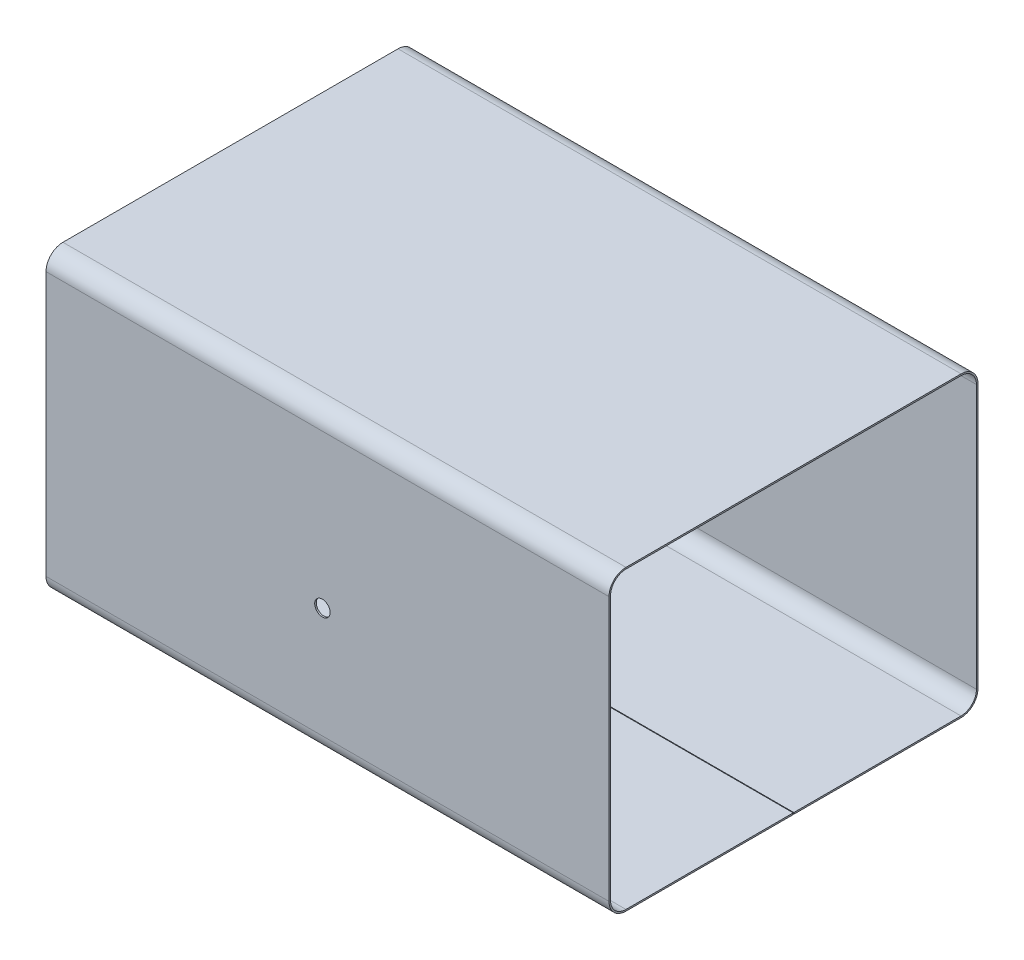
ISO-10303-21;
HEADER;
FILE_DESCRIPTION(('STEP AP214'),'2;1');
FILE_NAME('part.step','',(''),(''),'','','');
FILE_SCHEMA(('AUTOMOTIVE_DESIGN { 1 0 10303 214 1 1 1 1 }'));
ENDSEC;
DATA;
#1=APPLICATION_CONTEXT('core data for automotive mechanical design processes');
#2=APPLICATION_PROTOCOL_DEFINITION('international standard','automotive_design',2000,#1);
#3=PRODUCT_CONTEXT('',#1,'mechanical');
#4=PRODUCT('Part','Part','',(#3));
#5=PRODUCT_RELATED_PRODUCT_CATEGORY('part','',(#4));
#6=PRODUCT_DEFINITION_FORMATION('','',#4);
#7=PRODUCT_DEFINITION_CONTEXT('part definition',#1,'design');
#8=PRODUCT_DEFINITION('design','',#6,#7);
#9=PRODUCT_DEFINITION_SHAPE('','',#8);
#10=(LENGTH_UNIT() NAMED_UNIT(*) SI_UNIT(.MILLI.,.METRE.));
#11=(NAMED_UNIT(*) PLANE_ANGLE_UNIT() SI_UNIT($,.RADIAN.));
#12=(NAMED_UNIT(*) SI_UNIT($,.STERADIAN.) SOLID_ANGLE_UNIT());
#13=UNCERTAINTY_MEASURE_WITH_UNIT(LENGTH_MEASURE(1.E-05),#10,'distance_accuracy_value','');
#14=(GEOMETRIC_REPRESENTATION_CONTEXT(3) GLOBAL_UNCERTAINTY_ASSIGNED_CONTEXT((#13)) GLOBAL_UNIT_ASSIGNED_CONTEXT((#10,
#11,#12)) REPRESENTATION_CONTEXT('',''));
#15=CARTESIAN_POINT('',(0.,0.,0.));
#16=DIRECTION('',(0.,0.,1.));
#17=DIRECTION('',(1.,0.,0.));
#18=AXIS2_PLACEMENT_3D('',#15,#16,#17);
#19=CARTESIAN_POINT('',(-182.7,-48.3186465873429,54.3691641497024));
#20=DIRECTION('',(0.,-1.,0.));
#21=DIRECTION('',(0.,0.,-1.));
#22=AXIS2_PLACEMENT_3D('',#19,#20,#21);
#23=PLANE('',#22);
#24=DIRECTION('',(0.,0.,-1.));
#25=VECTOR('',#24,1.);
#26=CARTESIAN_POINT('',(0.,-48.3186465873429,54.3691641497024));
#27=LINE('',#26,#25);
#28=CARTESIAN_POINT('',(0.,-48.3186465873429,54.3691641497024));
#29=VERTEX_POINT('',#28);
#30=CARTESIAN_POINT('',(0.,-48.3186465873429,0.100000000000003));
#31=VERTEX_POINT('',#30);
#32=EDGE_CURVE('E204',#29,#31,#27,.T.);
#33=ORIENTED_EDGE('',*,*,#32,.F.);
#34=DIRECTION('',(1.,0.,0.));
#35=VECTOR('',#34,1.);
#36=CARTESIAN_POINT('',(-182.7,-48.3186465873429,54.3691641497024));
#37=LINE('',#36,#35);
#38=CARTESIAN_POINT('',(-182.7,-48.3186465873429,54.3691641497024));
#39=VERTEX_POINT('',#38);
#40=EDGE_CURVE('E11',#39,#29,#37,.T.);
#41=ORIENTED_EDGE('',*,*,#40,.F.);
#42=DIRECTION('',(0.,0.,-1.));
#43=VECTOR('',#42,1.);
#44=CARTESIAN_POINT('',(-182.7,-48.3186465873429,54.3691641497024));
#45=LINE('',#44,#43);
#46=CARTESIAN_POINT('',(-182.7,-48.3186465873429,0.100000000000003));
#47=VERTEX_POINT('',#46);
#48=EDGE_CURVE('E251',#39,#47,#45,.T.);
#49=ORIENTED_EDGE('',*,*,#48,.T.);
#50=DIRECTION('',(1.,0.,0.));
#51=VECTOR('',#50,1.);
#52=CARTESIAN_POINT('',(-182.7,-48.3186465873429,0.100000000000003));
#53=LINE('',#52,#51);
#54=EDGE_CURVE('E203',#47,#31,#53,.T.);
#55=ORIENTED_EDGE('',*,*,#54,.T.);
#56=EDGE_LOOP('',(#33,#41,#49,#55));
#57=FACE_BOUND('',#56,.T.);
#58=ADVANCED_FACE('F35',(#57),#23,.T.);
#59=CARTESIAN_POINT('',(-182.7,-42.8186465873429,54.3691641497024));
#60=DIRECTION('',(1.,0.,0.));
#61=DIRECTION('',(0.,0.,-1.));
#62=AXIS2_PLACEMENT_3D('',#59,#60,#61);
#63=CYLINDRICAL_SURFACE('',#62,5.5);
#64=CARTESIAN_POINT('',(0.,-42.8186465873429,54.3691641497024));
#65=DIRECTION('',(1.,0.,0.));
#66=DIRECTION('',(0.,0.,-1.));
#67=AXIS2_PLACEMENT_3D('',#64,#65,#66);
#68=CIRCLE('',#67,5.5);
#69=CARTESIAN_POINT('',(0.,-42.8186465873429,59.8691641497024));
#70=VERTEX_POINT('',#69);
#71=EDGE_CURVE('E249',#70,#29,#68,.T.);
#72=ORIENTED_EDGE('',*,*,#71,.F.);
#73=DIRECTION('',(1.,0.,0.));
#74=VECTOR('',#73,1.);
#75=CARTESIAN_POINT('',(-182.7,-42.8186465873429,59.8691641497024));
#76=LINE('',#75,#74);
#77=CARTESIAN_POINT('',(-182.7,-42.8186465873429,59.8691641497024));
#78=VERTEX_POINT('',#77);
#79=EDGE_CURVE('E44',#78,#70,#76,.T.);
#80=ORIENTED_EDGE('',*,*,#79,.F.);
#81=CARTESIAN_POINT('',(-182.7,-42.8186465873429,54.3691641497024));
#82=DIRECTION('',(1.,0.,0.));
#83=DIRECTION('',(0.,0.,-1.));
#84=AXIS2_PLACEMENT_3D('',#81,#82,#83);
#85=CIRCLE('',#84,5.5);
#86=EDGE_CURVE('E193',#78,#39,#85,.T.);
#87=ORIENTED_EDGE('',*,*,#86,.T.);
#88=ORIENTED_EDGE('',*,*,#40,.T.);
#89=EDGE_LOOP('',(#72,#80,#87,#88));
#90=FACE_BOUND('',#89,.T.);
#91=ADVANCED_FACE('F301',(#90),#63,.T.);
#92=CARTESIAN_POINT('',(-182.7,-42.8186465873429,59.8691641497024));
#93=DIRECTION('',(0.,0.,1.));
#94=DIRECTION('',(1.,0.,0.));
#95=AXIS2_PLACEMENT_3D('',#92,#93,#94);
#96=PLANE('',#95);
#97=CARTESIAN_POINT('',(-93.0069468006124,-6.88677821628847,59.8691641497024));
#98=DIRECTION('',(0.,0.,1.));
#99=DIRECTION('',(1.,0.,0.));
#100=AXIS2_PLACEMENT_3D('',#97,#98,#99);
#101=CIRCLE('',#100,2.5);
#102=CARTESIAN_POINT('',(-90.5069468006124,-6.88677821628847,59.8691641497024));
#103=VERTEX_POINT('',#102);
#104=EDGE_CURVE('E400',#103,#103,#101,.T.);
#105=ORIENTED_EDGE('',*,*,#104,.F.);
#106=EDGE_LOOP('',(#105));
#107=FACE_BOUND('',#106,.T.);
#108=DIRECTION('',(0.,1.,0.));
#109=VECTOR('',#108,1.);
#110=CARTESIAN_POINT('',(0.,-42.8186465873429,59.8691641497024));
#111=LINE('',#110,#109);
#112=CARTESIAN_POINT('',(0.,42.8186465873429,59.8691641497024));
#113=VERTEX_POINT('',#112);
#114=EDGE_CURVE('E181',#113,#70,#111,.F.);
#115=ORIENTED_EDGE('',*,*,#114,.F.);
#116=DIRECTION('',(1.,0.,0.));
#117=VECTOR('',#116,1.);
#118=CARTESIAN_POINT('',(-182.7,42.8186465873429,59.8691641497024));
#119=LINE('',#118,#117);
#120=CARTESIAN_POINT('',(-182.7,42.8186465873429,59.8691641497024));
#121=VERTEX_POINT('',#120);
#122=EDGE_CURVE('E176',#121,#113,#119,.T.);
#123=ORIENTED_EDGE('',*,*,#122,.F.);
#124=DIRECTION('',(0.,1.,0.));
#125=VECTOR('',#124,1.);
#126=CARTESIAN_POINT('',(-182.7,-42.8186465873429,59.8691641497024));
#127=LINE('',#126,#125);
#128=EDGE_CURVE('E179',#121,#78,#127,.F.);
#129=ORIENTED_EDGE('',*,*,#128,.T.);
#130=ORIENTED_EDGE('',*,*,#79,.T.);
#131=EDGE_LOOP('',(#115,#123,#129,#130));
#132=FACE_BOUND('',#131,.T.);
#133=ADVANCED_FACE('F178',(#107,#132),#96,.T.);
#134=CARTESIAN_POINT('',(-182.7,42.8186465873429,54.3691641497024));
#135=DIRECTION('',(1.,0.,0.));
#136=DIRECTION('',(0.,0.,-1.));
#137=AXIS2_PLACEMENT_3D('',#134,#135,#136);
#138=CYLINDRICAL_SURFACE('',#137,5.5);
#139=CARTESIAN_POINT('',(0.,42.8186465873429,54.3691641497024));
#140=DIRECTION('',(1.,0.,0.));
#141=DIRECTION('',(0.,0.,-1.));
#142=AXIS2_PLACEMENT_3D('',#139,#140,#141);
#143=CIRCLE('',#142,5.5);
#144=CARTESIAN_POINT('',(0.,48.3186465873429,54.3691641497024));
#145=VERTEX_POINT('',#144);
#146=EDGE_CURVE('E246',#145,#113,#143,.T.);
#147=ORIENTED_EDGE('',*,*,#146,.F.);
#148=DIRECTION('',(1.,0.,0.));
#149=VECTOR('',#148,1.);
#150=CARTESIAN_POINT('',(-182.7,48.3186465873429,54.3691641497024));
#151=LINE('',#150,#149);
#152=CARTESIAN_POINT('',(-182.7,48.3186465873429,54.3691641497024));
#153=VERTEX_POINT('',#152);
#154=EDGE_CURVE('E186',#153,#145,#151,.T.);
#155=ORIENTED_EDGE('',*,*,#154,.F.);
#156=CARTESIAN_POINT('',(-182.7,42.8186465873429,54.3691641497024));
#157=DIRECTION('',(1.,0.,0.));
#158=DIRECTION('',(0.,0.,-1.));
#159=AXIS2_PLACEMENT_3D('',#156,#157,#158);
#160=CIRCLE('',#159,5.5);
#161=EDGE_CURVE('E191',#153,#121,#160,.T.);
#162=ORIENTED_EDGE('',*,*,#161,.T.);
#163=ORIENTED_EDGE('',*,*,#122,.T.);
#164=EDGE_LOOP('',(#147,#155,#162,#163));
#165=FACE_BOUND('',#164,.T.);
#166=ADVANCED_FACE('F195',(#165),#138,.T.);
#167=CARTESIAN_POINT('',(-182.7,48.3186465873429,54.3691641497024));
#168=DIRECTION('',(0.,1.,0.));
#169=DIRECTION('',(0.,0.,1.));
#170=AXIS2_PLACEMENT_3D('',#167,#168,#169);
#171=PLANE('',#170);
#172=DIRECTION('',(0.,0.,-1.));
#173=VECTOR('',#172,1.);
#174=CARTESIAN_POINT('',(0.,48.3186465873429,54.3691641497024));
#175=LINE('',#174,#173);
#176=CARTESIAN_POINT('',(0.,48.3186465873429,-54.3691641497024));
#177=VERTEX_POINT('',#176);
#178=EDGE_CURVE('E243',#177,#145,#175,.F.);
#179=ORIENTED_EDGE('',*,*,#178,.F.);
#180=DIRECTION('',(1.,0.,0.));
#181=VECTOR('',#180,1.);
#182=CARTESIAN_POINT('',(-182.7,48.3186465873429,-54.3691641497024));
#183=LINE('',#182,#181);
#184=CARTESIAN_POINT('',(-182.7,48.3186465873429,-54.3691641497024));
#185=VERTEX_POINT('',#184);
#186=EDGE_CURVE('E255',#185,#177,#183,.T.);
#187=ORIENTED_EDGE('',*,*,#186,.F.);
#188=DIRECTION('',(0.,0.,-1.));
#189=VECTOR('',#188,1.);
#190=CARTESIAN_POINT('',(-182.7,48.3186465873429,54.3691641497024));
#191=LINE('',#190,#189);
#192=EDGE_CURVE('E196',#185,#153,#191,.F.);
#193=ORIENTED_EDGE('',*,*,#192,.T.);
#194=ORIENTED_EDGE('',*,*,#154,.T.);
#195=EDGE_LOOP('',(#179,#187,#193,#194));
#196=FACE_BOUND('',#195,.T.);
#197=ADVANCED_FACE('F315',(#196),#171,.T.);
#198=CARTESIAN_POINT('',(-182.7,42.8186465873429,-54.3691641497024));
#199=DIRECTION('',(1.,0.,0.));
#200=DIRECTION('',(0.,0.,-1.));
#201=AXIS2_PLACEMENT_3D('',#198,#199,#200);
#202=CYLINDRICAL_SURFACE('',#201,5.5);
#203=CARTESIAN_POINT('',(0.,42.8186465873429,-54.3691641497024));
#204=DIRECTION('',(1.,0.,0.));
#205=DIRECTION('',(0.,0.,-1.));
#206=AXIS2_PLACEMENT_3D('',#203,#204,#205);
#207=CIRCLE('',#206,5.5);
#208=CARTESIAN_POINT('',(0.,42.8186465873429,-59.8691641497024));
#209=VERTEX_POINT('',#208);
#210=EDGE_CURVE('E240',#209,#177,#207,.T.);
#211=ORIENTED_EDGE('',*,*,#210,.F.);
#212=DIRECTION('',(1.,0.,0.));
#213=VECTOR('',#212,1.);
#214=CARTESIAN_POINT('',(-182.7,42.8186465873429,-59.8691641497024));
#215=LINE('',#214,#213);
#216=CARTESIAN_POINT('',(-182.7,42.8186465873429,-59.8691641497024));
#217=VERTEX_POINT('',#216);
#218=EDGE_CURVE('E257',#217,#209,#215,.T.);
#219=ORIENTED_EDGE('',*,*,#218,.F.);
#220=CARTESIAN_POINT('',(-182.7,42.8186465873429,-54.3691641497024));
#221=DIRECTION('',(1.,0.,0.));
#222=DIRECTION('',(0.,0.,-1.));
#223=AXIS2_PLACEMENT_3D('',#220,#221,#222);
#224=CIRCLE('',#223,5.5);
#225=EDGE_CURVE('E198',#217,#185,#224,.T.);
#226=ORIENTED_EDGE('',*,*,#225,.T.);
#227=ORIENTED_EDGE('',*,*,#186,.T.);
#228=EDGE_LOOP('',(#211,#219,#226,#227));
#229=FACE_BOUND('',#228,.T.);
#230=ADVANCED_FACE('F318',(#229),#202,.T.);
#231=CARTESIAN_POINT('',(-182.7,-42.818646587343,-59.8691641497024));
#232=DIRECTION('',(0.,0.,-1.));
#233=DIRECTION('',(-1.,0.,0.));
#234=AXIS2_PLACEMENT_3D('',#231,#232,#233);
#235=PLANE('',#234);
#236=CARTESIAN_POINT('',(-93.0069468006124,-6.88677821628847,-59.8691641497024));
#237=DIRECTION('',(0.,0.,1.));
#238=DIRECTION('',(1.,0.,0.));
#239=AXIS2_PLACEMENT_3D('',#236,#237,#238);
#240=CIRCLE('',#239,2.5);
#241=CARTESIAN_POINT('',(-90.5069468006124,-6.88677821628847,-59.8691641497024));
#242=VERTEX_POINT('',#241);
#243=EDGE_CURVE('E393',#242,#242,#240,.T.);
#244=ORIENTED_EDGE('',*,*,#243,.T.);
#245=EDGE_LOOP('',(#244));
#246=FACE_BOUND('',#245,.T.);
#247=DIRECTION('',(0.,1.,0.));
#248=VECTOR('',#247,1.);
#249=CARTESIAN_POINT('',(0.,-42.818646587343,-59.8691641497024));
#250=LINE('',#249,#248);
#251=CARTESIAN_POINT('',(0.,-42.818646587343,-59.8691641497024));
#252=VERTEX_POINT('',#251);
#253=EDGE_CURVE('E237',#252,#209,#250,.T.);
#254=ORIENTED_EDGE('',*,*,#253,.F.);
#255=DIRECTION('',(1.,0.,0.));
#256=VECTOR('',#255,1.);
#257=CARTESIAN_POINT('',(-182.7,-42.818646587343,-59.8691641497024));
#258=LINE('',#257,#256);
#259=CARTESIAN_POINT('',(-182.7,-42.818646587343,-59.8691641497024));
#260=VERTEX_POINT('',#259);
#261=EDGE_CURVE('E259',#260,#252,#258,.T.);
#262=ORIENTED_EDGE('',*,*,#261,.F.);
#263=DIRECTION('',(0.,1.,0.));
#264=VECTOR('',#263,1.);
#265=CARTESIAN_POINT('',(-182.7,-42.818646587343,-59.8691641497024));
#266=LINE('',#265,#264);
#267=EDGE_CURVE('E430',#260,#217,#266,.T.);
#268=ORIENTED_EDGE('',*,*,#267,.T.);
#269=ORIENTED_EDGE('',*,*,#218,.T.);
#270=EDGE_LOOP('',(#254,#262,#268,#269));
#271=FACE_BOUND('',#270,.T.);
#272=ADVANCED_FACE('F322',(#246,#271),#235,.T.);
#273=CARTESIAN_POINT('',(-182.7,-42.818646587343,-54.3691641497024));
#274=DIRECTION('',(1.,0.,0.));
#275=DIRECTION('',(0.,0.,-1.));
#276=AXIS2_PLACEMENT_3D('',#273,#274,#275);
#277=CYLINDRICAL_SURFACE('',#276,5.5);
#278=CARTESIAN_POINT('',(0.,-42.818646587343,-54.3691641497024));
#279=DIRECTION('',(1.,0.,0.));
#280=DIRECTION('',(0.,0.,-1.));
#281=AXIS2_PLACEMENT_3D('',#278,#279,#280);
#282=CIRCLE('',#281,5.5);
#283=CARTESIAN_POINT('',(0.,-48.318646587343,-54.3691641497024));
#284=VERTEX_POINT('',#283);
#285=EDGE_CURVE('E234',#284,#252,#282,.T.);
#286=ORIENTED_EDGE('',*,*,#285,.F.);
#287=DIRECTION('',(1.,0.,0.));
#288=VECTOR('',#287,1.);
#289=CARTESIAN_POINT('',(-182.7,-48.318646587343,-54.3691641497024));
#290=LINE('',#289,#288);
#291=CARTESIAN_POINT('',(-182.7,-48.318646587343,-54.3691641497024));
#292=VERTEX_POINT('',#291);
#293=EDGE_CURVE('E261',#292,#284,#290,.T.);
#294=ORIENTED_EDGE('',*,*,#293,.F.);
#295=CARTESIAN_POINT('',(-182.7,-42.818646587343,-54.3691641497024));
#296=DIRECTION('',(1.,0.,0.));
#297=DIRECTION('',(0.,0.,-1.));
#298=AXIS2_PLACEMENT_3D('',#295,#296,#297);
#299=CIRCLE('',#298,5.5);
#300=EDGE_CURVE('E427',#292,#260,#299,.T.);
#301=ORIENTED_EDGE('',*,*,#300,.T.);
#302=ORIENTED_EDGE('',*,*,#261,.T.);
#303=EDGE_LOOP('',(#286,#294,#301,#302));
#304=FACE_BOUND('',#303,.T.);
#305=ADVANCED_FACE('F326',(#304),#277,.T.);
#306=CARTESIAN_POINT('',(-182.7,-48.318646587343,-0.0999999999999999));
#307=DIRECTION('',(0.,-1.,0.));
#308=DIRECTION('',(0.,0.,-1.));
#309=AXIS2_PLACEMENT_3D('',#306,#307,#308);
#310=PLANE('',#309);
#311=DIRECTION('',(0.,0.,-1.));
#312=VECTOR('',#311,1.);
#313=CARTESIAN_POINT('',(0.,-48.318646587343,-0.0999999999999999));
#314=LINE('',#313,#312);
#315=CARTESIAN_POINT('',(0.,-48.318646587343,-0.0999999999999999));
#316=VERTEX_POINT('',#315);
#317=EDGE_CURVE('E231',#316,#284,#314,.T.);
#318=ORIENTED_EDGE('',*,*,#317,.F.);
#319=DIRECTION('',(1.,0.,0.));
#320=VECTOR('',#319,1.);
#321=CARTESIAN_POINT('',(-182.7,-48.318646587343,-0.0999999999999999));
#322=LINE('',#321,#320);
#323=CARTESIAN_POINT('',(-182.7,-48.318646587343,-0.0999999999999999));
#324=VERTEX_POINT('',#323);
#325=EDGE_CURVE('E263',#324,#316,#322,.T.);
#326=ORIENTED_EDGE('',*,*,#325,.F.);
#327=DIRECTION('',(0.,0.,-1.));
#328=VECTOR('',#327,1.);
#329=CARTESIAN_POINT('',(-182.7,-48.318646587343,-0.0999999999999999));
#330=LINE('',#329,#328);
#331=EDGE_CURVE('E424',#324,#292,#330,.T.);
#332=ORIENTED_EDGE('',*,*,#331,.T.);
#333=ORIENTED_EDGE('',*,*,#293,.T.);
#334=EDGE_LOOP('',(#318,#326,#332,#333));
#335=FACE_BOUND('',#334,.T.);
#336=ADVANCED_FACE('F330',(#335),#310,.T.);
#337=CARTESIAN_POINT('',(-182.7,-48.318646587343,-0.0999999999999999));
#338=DIRECTION('',(0.,0.,-1.));
#339=DIRECTION('',(0.,1.,0.));
#340=AXIS2_PLACEMENT_3D('',#337,#338,#339);
#341=PLANE('',#340);
#342=DIRECTION('',(0.,1.,0.));
#343=VECTOR('',#342,1.);
#344=CARTESIAN_POINT('',(0.,-48.318646587343,-0.0999999999999999));
#345=LINE('',#344,#343);
#346=CARTESIAN_POINT('',(0.,-47.818646587343,-0.1));
#347=VERTEX_POINT('',#346);
#348=EDGE_CURVE('E229',#316,#347,#345,.T.);
#349=ORIENTED_EDGE('',*,*,#348,.T.);
#350=DIRECTION('',(1.,0.,0.));
#351=VECTOR('',#350,1.);
#352=CARTESIAN_POINT('',(-182.7,-47.818646587343,-0.1));
#353=LINE('',#352,#351);
#354=CARTESIAN_POINT('',(-182.7,-47.818646587343,-0.1));
#355=VERTEX_POINT('',#354);
#356=EDGE_CURVE('E265',#355,#347,#353,.T.);
#357=ORIENTED_EDGE('',*,*,#356,.F.);
#358=DIRECTION('',(0.,1.,0.));
#359=VECTOR('',#358,1.);
#360=CARTESIAN_POINT('',(-182.7,-48.318646587343,-0.0999999999999999));
#361=LINE('',#360,#359);
#362=EDGE_CURVE('E422',#324,#355,#361,.T.);
#363=ORIENTED_EDGE('',*,*,#362,.F.);
#364=ORIENTED_EDGE('',*,*,#325,.T.);
#365=EDGE_LOOP('',(#349,#357,#363,#364));
#366=FACE_BOUND('',#365,.T.);
#367=ADVANCED_FACE('F334',(#366),#341,.F.);
#368=CARTESIAN_POINT('',(-182.7,-47.818646587343,-0.1));
#369=DIRECTION('',(0.,-1.,0.));
#370=DIRECTION('',(0.,0.,-1.));
#371=AXIS2_PLACEMENT_3D('',#368,#369,#370);
#372=PLANE('',#371);
#373=DIRECTION('',(0.,0.,-1.));
#374=VECTOR('',#373,1.);
#375=CARTESIAN_POINT('',(0.,-47.818646587343,-0.1));
#376=LINE('',#375,#374);
#377=CARTESIAN_POINT('',(0.,-47.818646587343,-54.3691641497024));
#378=VERTEX_POINT('',#377);
#379=EDGE_CURVE('E227',#347,#378,#376,.T.);
#380=ORIENTED_EDGE('',*,*,#379,.T.);
#381=DIRECTION('',(1.,0.,0.));
#382=VECTOR('',#381,1.);
#383=CARTESIAN_POINT('',(-182.7,-47.818646587343,-54.3691641497024));
#384=LINE('',#383,#382);
#385=CARTESIAN_POINT('',(-182.7,-47.818646587343,-54.3691641497024));
#386=VERTEX_POINT('',#385);
#387=EDGE_CURVE('E268',#386,#378,#384,.T.);
#388=ORIENTED_EDGE('',*,*,#387,.F.);
#389=DIRECTION('',(0.,0.,-1.));
#390=VECTOR('',#389,1.);
#391=CARTESIAN_POINT('',(-182.7,-47.818646587343,-0.1));
#392=LINE('',#391,#390);
#393=EDGE_CURVE('E420',#355,#386,#392,.T.);
#394=ORIENTED_EDGE('',*,*,#393,.F.);
#395=ORIENTED_EDGE('',*,*,#356,.T.);
#396=EDGE_LOOP('',(#380,#388,#394,#395));
#397=FACE_BOUND('',#396,.T.);
#398=ADVANCED_FACE('F338',(#397),#372,.F.);
#399=CARTESIAN_POINT('',(-182.7,-42.818646587343,-54.3691641497024));
#400=DIRECTION('',(1.,0.,0.));
#401=DIRECTION('',(0.,0.,-1.));
#402=AXIS2_PLACEMENT_3D('',#399,#400,#401);
#403=CYLINDRICAL_SURFACE('',#402,5.);
#404=CARTESIAN_POINT('',(0.,-42.818646587343,-54.3691641497024));
#405=DIRECTION('',(1.,0.,0.));
#406=DIRECTION('',(0.,0.,1.));
#407=AXIS2_PLACEMENT_3D('',#404,#405,#406);
#408=CIRCLE('',#407,5.);
#409=CARTESIAN_POINT('',(0.,-42.818646587343,-59.3691641497024));
#410=VERTEX_POINT('',#409);
#411=EDGE_CURVE('E225',#378,#410,#408,.T.);
#412=ORIENTED_EDGE('',*,*,#411,.T.);
#413=DIRECTION('',(1.,0.,0.));
#414=VECTOR('',#413,1.);
#415=CARTESIAN_POINT('',(-182.7,-42.818646587343,-59.3691641497024));
#416=LINE('',#415,#414);
#417=CARTESIAN_POINT('',(-182.7,-42.818646587343,-59.3691641497024));
#418=VERTEX_POINT('',#417);
#419=EDGE_CURVE('E271',#418,#410,#416,.T.);
#420=ORIENTED_EDGE('',*,*,#419,.F.);
#421=CARTESIAN_POINT('',(-182.7,-42.818646587343,-54.3691641497024));
#422=DIRECTION('',(1.,0.,0.));
#423=DIRECTION('',(0.,0.,1.));
#424=AXIS2_PLACEMENT_3D('',#421,#422,#423);
#425=CIRCLE('',#424,5.);
#426=EDGE_CURVE('E418',#386,#418,#425,.T.);
#427=ORIENTED_EDGE('',*,*,#426,.F.);
#428=ORIENTED_EDGE('',*,*,#387,.T.);
#429=EDGE_LOOP('',(#412,#420,#427,#428));
#430=FACE_BOUND('',#429,.T.);
#431=ADVANCED_FACE('F342',(#430),#403,.F.);
#432=CARTESIAN_POINT('',(-182.7,-42.818646587343,-59.3691641497024));
#433=DIRECTION('',(0.,0.,-1.));
#434=DIRECTION('',(-1.,0.,0.));
#435=AXIS2_PLACEMENT_3D('',#432,#433,#434);
#436=PLANE('',#435);
#437=CARTESIAN_POINT('',(-93.0069468006124,-6.88677821628847,-59.3691641497024));
#438=DIRECTION('',(0.,0.,-1.));
#439=DIRECTION('',(-1.,0.,0.));
#440=AXIS2_PLACEMENT_3D('',#437,#438,#439);
#441=CIRCLE('',#440,2.5);
#442=CARTESIAN_POINT('',(-95.5069468006124,-6.88677821628847,-59.3691641497024));
#443=VERTEX_POINT('',#442);
#444=EDGE_CURVE('E208',#443,#443,#441,.T.);
#445=ORIENTED_EDGE('',*,*,#444,.T.);
#446=EDGE_LOOP('',(#445));
#447=FACE_BOUND('',#446,.T.);
#448=DIRECTION('',(0.,1.,0.));
#449=VECTOR('',#448,1.);
#450=CARTESIAN_POINT('',(0.,-42.818646587343,-59.3691641497024));
#451=LINE('',#450,#449);
#452=CARTESIAN_POINT('',(0.,42.8186465873429,-59.3691641497024));
#453=VERTEX_POINT('',#452);
#454=EDGE_CURVE('E223',#410,#453,#451,.T.);
#455=ORIENTED_EDGE('',*,*,#454,.T.);
#456=DIRECTION('',(1.,0.,0.));
#457=VECTOR('',#456,1.);
#458=CARTESIAN_POINT('',(-182.7,42.8186465873429,-59.3691641497024));
#459=LINE('',#458,#457);
#460=CARTESIAN_POINT('',(-182.7,42.8186465873429,-59.3691641497024));
#461=VERTEX_POINT('',#460);
#462=EDGE_CURVE('E274',#461,#453,#459,.T.);
#463=ORIENTED_EDGE('',*,*,#462,.F.);
#464=DIRECTION('',(0.,1.,0.));
#465=VECTOR('',#464,1.);
#466=CARTESIAN_POINT('',(-182.7,-42.818646587343,-59.3691641497024));
#467=LINE('',#466,#465);
#468=EDGE_CURVE('E416',#418,#461,#467,.T.);
#469=ORIENTED_EDGE('',*,*,#468,.F.);
#470=ORIENTED_EDGE('',*,*,#419,.T.);
#471=EDGE_LOOP('',(#455,#463,#469,#470));
#472=FACE_BOUND('',#471,.T.);
#473=ADVANCED_FACE('F346',(#447,#472),#436,.F.);
#474=CARTESIAN_POINT('',(-182.7,42.8186465873429,-54.3691641497024));
#475=DIRECTION('',(1.,0.,0.));
#476=DIRECTION('',(0.,0.,-1.));
#477=AXIS2_PLACEMENT_3D('',#474,#475,#476);
#478=CYLINDRICAL_SURFACE('',#477,5.);
#479=CARTESIAN_POINT('',(0.,42.8186465873429,-54.3691641497024));
#480=DIRECTION('',(1.,0.,0.));
#481=DIRECTION('',(0.,0.,-1.));
#482=AXIS2_PLACEMENT_3D('',#479,#480,#481);
#483=CIRCLE('',#482,5.);
#484=CARTESIAN_POINT('',(0.,47.8186465873429,-54.3691641497024));
#485=VERTEX_POINT('',#484);
#486=EDGE_CURVE('E221',#453,#485,#483,.T.);
#487=ORIENTED_EDGE('',*,*,#486,.T.);
#488=DIRECTION('',(1.,0.,0.));
#489=VECTOR('',#488,1.);
#490=CARTESIAN_POINT('',(-182.7,47.8186465873429,-54.3691641497024));
#491=LINE('',#490,#489);
#492=CARTESIAN_POINT('',(-182.7,47.8186465873429,-54.3691641497024));
#493=VERTEX_POINT('',#492);
#494=EDGE_CURVE('E277',#493,#485,#491,.T.);
#495=ORIENTED_EDGE('',*,*,#494,.F.);
#496=CARTESIAN_POINT('',(-182.7,42.8186465873429,-54.3691641497024));
#497=DIRECTION('',(1.,0.,0.));
#498=DIRECTION('',(0.,0.,-1.));
#499=AXIS2_PLACEMENT_3D('',#496,#497,#498);
#500=CIRCLE('',#499,5.);
#501=EDGE_CURVE('E414',#461,#493,#500,.T.);
#502=ORIENTED_EDGE('',*,*,#501,.F.);
#503=ORIENTED_EDGE('',*,*,#462,.T.);
#504=EDGE_LOOP('',(#487,#495,#502,#503));
#505=FACE_BOUND('',#504,.T.);
#506=ADVANCED_FACE('F350',(#505),#478,.F.);
#507=CARTESIAN_POINT('',(-182.7,47.8186465873429,54.3691641497024));
#508=DIRECTION('',(0.,1.,0.));
#509=DIRECTION('',(0.,0.,1.));
#510=AXIS2_PLACEMENT_3D('',#507,#508,#509);
#511=PLANE('',#510);
#512=DIRECTION('',(0.,0.,1.));
#513=VECTOR('',#512,1.);
#514=CARTESIAN_POINT('',(0.,47.8186465873429,54.3691641497024));
#515=LINE('',#514,#513);
#516=CARTESIAN_POINT('',(0.,47.8186465873429,54.3691641497024));
#517=VERTEX_POINT('',#516);
#518=EDGE_CURVE('E219',#485,#517,#515,.T.);
#519=ORIENTED_EDGE('',*,*,#518,.T.);
#520=DIRECTION('',(1.,0.,0.));
#521=VECTOR('',#520,1.);
#522=CARTESIAN_POINT('',(-182.7,47.8186465873429,54.3691641497024));
#523=LINE('',#522,#521);
#524=CARTESIAN_POINT('',(-182.7,47.8186465873429,54.3691641497024));
#525=VERTEX_POINT('',#524);
#526=EDGE_CURVE('E280',#525,#517,#523,.T.);
#527=ORIENTED_EDGE('',*,*,#526,.F.);
#528=DIRECTION('',(0.,0.,1.));
#529=VECTOR('',#528,1.);
#530=CARTESIAN_POINT('',(-182.7,47.8186465873429,54.3691641497024));
#531=LINE('',#530,#529);
#532=EDGE_CURVE('E412',#493,#525,#531,.T.);
#533=ORIENTED_EDGE('',*,*,#532,.F.);
#534=ORIENTED_EDGE('',*,*,#494,.T.);
#535=EDGE_LOOP('',(#519,#527,#533,#534));
#536=FACE_BOUND('',#535,.T.);
#537=ADVANCED_FACE('F354',(#536),#511,.F.);
#538=CARTESIAN_POINT('',(-182.7,42.8186465873429,54.3691641497024));
#539=DIRECTION('',(1.,0.,0.));
#540=DIRECTION('',(0.,0.,-1.));
#541=AXIS2_PLACEMENT_3D('',#538,#539,#540);
#542=CYLINDRICAL_SURFACE('',#541,5.);
#543=CARTESIAN_POINT('',(0.,42.8186465873429,54.3691641497024));
#544=DIRECTION('',(1.,0.,0.));
#545=DIRECTION('',(0.,0.,1.));
#546=AXIS2_PLACEMENT_3D('',#543,#544,#545);
#547=CIRCLE('',#546,5.);
#548=CARTESIAN_POINT('',(0.,42.8186465873429,59.3691641497024));
#549=VERTEX_POINT('',#548);
#550=EDGE_CURVE('E217',#517,#549,#547,.T.);
#551=ORIENTED_EDGE('',*,*,#550,.T.);
#552=DIRECTION('',(1.,0.,0.));
#553=VECTOR('',#552,1.);
#554=CARTESIAN_POINT('',(-182.7,42.8186465873429,59.3691641497024));
#555=LINE('',#554,#553);
#556=CARTESIAN_POINT('',(-182.7,42.8186465873429,59.3691641497024));
#557=VERTEX_POINT('',#556);
#558=EDGE_CURVE('E283',#557,#549,#555,.T.);
#559=ORIENTED_EDGE('',*,*,#558,.F.);
#560=CARTESIAN_POINT('',(-182.7,42.8186465873429,54.3691641497024));
#561=DIRECTION('',(1.,0.,0.));
#562=DIRECTION('',(0.,0.,1.));
#563=AXIS2_PLACEMENT_3D('',#560,#561,#562);
#564=CIRCLE('',#563,5.);
#565=EDGE_CURVE('E410',#525,#557,#564,.T.);
#566=ORIENTED_EDGE('',*,*,#565,.F.);
#567=ORIENTED_EDGE('',*,*,#526,.T.);
#568=EDGE_LOOP('',(#551,#559,#566,#567));
#569=FACE_BOUND('',#568,.T.);
#570=ADVANCED_FACE('F358',(#569),#542,.F.);
#571=CARTESIAN_POINT('',(-182.7,-42.8186465873429,59.3691641497024));
#572=DIRECTION('',(0.,0.,1.));
#573=DIRECTION('',(1.,0.,0.));
#574=AXIS2_PLACEMENT_3D('',#571,#572,#573);
#575=PLANE('',#574);
#576=CARTESIAN_POINT('',(-93.0069468006124,-6.88677821628847,59.3691641497024));
#577=DIRECTION('',(0.,0.,1.));
#578=DIRECTION('',(1.,0.,0.));
#579=AXIS2_PLACEMENT_3D('',#576,#577,#578);
#580=CIRCLE('',#579,2.5);
#581=CARTESIAN_POINT('',(-90.5069468006124,-6.88677821628847,59.3691641497024));
#582=VERTEX_POINT('',#581);
#583=EDGE_CURVE('E38',#582,#582,#580,.T.);
#584=ORIENTED_EDGE('',*,*,#583,.T.);
#585=EDGE_LOOP('',(#584));
#586=FACE_BOUND('',#585,.T.);
#587=DIRECTION('',(0.,-1.,0.));
#588=VECTOR('',#587,1.);
#589=CARTESIAN_POINT('',(0.,-42.8186465873429,59.3691641497024));
#590=LINE('',#589,#588);
#591=CARTESIAN_POINT('',(0.,-42.8186465873429,59.3691641497024));
#592=VERTEX_POINT('',#591);
#593=EDGE_CURVE('E215',#549,#592,#590,.T.);
#594=ORIENTED_EDGE('',*,*,#593,.T.);
#595=DIRECTION('',(1.,0.,0.));
#596=VECTOR('',#595,1.);
#597=CARTESIAN_POINT('',(-182.7,-42.8186465873429,59.3691641497024));
#598=LINE('',#597,#596);
#599=CARTESIAN_POINT('',(-182.7,-42.8186465873429,59.3691641497024));
#600=VERTEX_POINT('',#599);
#601=EDGE_CURVE('E286',#600,#592,#598,.T.);
#602=ORIENTED_EDGE('',*,*,#601,.F.);
#603=DIRECTION('',(0.,-1.,0.));
#604=VECTOR('',#603,1.);
#605=CARTESIAN_POINT('',(-182.7,-42.8186465873429,59.3691641497024));
#606=LINE('',#605,#604);
#607=EDGE_CURVE('E408',#557,#600,#606,.T.);
#608=ORIENTED_EDGE('',*,*,#607,.F.);
#609=ORIENTED_EDGE('',*,*,#558,.T.);
#610=EDGE_LOOP('',(#594,#602,#608,#609));
#611=FACE_BOUND('',#610,.T.);
#612=ADVANCED_FACE('F362',(#586,#611),#575,.F.);
#613=CARTESIAN_POINT('',(-182.7,-42.8186465873429,54.3691641497024));
#614=DIRECTION('',(1.,0.,0.));
#615=DIRECTION('',(0.,0.,-1.));
#616=AXIS2_PLACEMENT_3D('',#613,#614,#615);
#617=CYLINDRICAL_SURFACE('',#616,5.);
#618=CARTESIAN_POINT('',(0.,-42.8186465873429,54.3691641497024));
#619=DIRECTION('',(1.,0.,0.));
#620=DIRECTION('',(0.,0.,-1.));
#621=AXIS2_PLACEMENT_3D('',#618,#619,#620);
#622=CIRCLE('',#621,5.);
#623=CARTESIAN_POINT('',(0.,-47.8186465873429,54.3691641497024));
#624=VERTEX_POINT('',#623);
#625=EDGE_CURVE('E213',#592,#624,#622,.T.);
#626=ORIENTED_EDGE('',*,*,#625,.T.);
#627=DIRECTION('',(1.,0.,0.));
#628=VECTOR('',#627,1.);
#629=CARTESIAN_POINT('',(-182.7,-47.8186465873429,54.3691641497024));
#630=LINE('',#629,#628);
#631=CARTESIAN_POINT('',(-182.7,-47.8186465873429,54.3691641497024));
#632=VERTEX_POINT('',#631);
#633=EDGE_CURVE('E289',#632,#624,#630,.T.);
#634=ORIENTED_EDGE('',*,*,#633,.F.);
#635=CARTESIAN_POINT('',(-182.7,-42.8186465873429,54.3691641497024));
#636=DIRECTION('',(1.,0.,0.));
#637=DIRECTION('',(0.,0.,-1.));
#638=AXIS2_PLACEMENT_3D('',#635,#636,#637);
#639=CIRCLE('',#638,5.);
#640=EDGE_CURVE('E406',#600,#632,#639,.T.);
#641=ORIENTED_EDGE('',*,*,#640,.F.);
#642=ORIENTED_EDGE('',*,*,#601,.T.);
#643=EDGE_LOOP('',(#626,#634,#641,#642));
#644=FACE_BOUND('',#643,.T.);
#645=ADVANCED_FACE('F366',(#644),#617,.F.);
#646=CARTESIAN_POINT('',(-182.7,-47.8186465873429,54.3691641497024));
#647=DIRECTION('',(0.,-1.,0.));
#648=DIRECTION('',(0.,0.,-1.));
#649=AXIS2_PLACEMENT_3D('',#646,#647,#648);
#650=PLANE('',#649);
#651=DIRECTION('',(0.,0.,-1.));
#652=VECTOR('',#651,1.);
#653=CARTESIAN_POINT('',(0.,-47.8186465873429,54.3691641497024));
#654=LINE('',#653,#652);
#655=CARTESIAN_POINT('',(0.,-47.8186465873429,0.1));
#656=VERTEX_POINT('',#655);
#657=EDGE_CURVE('E211',#624,#656,#654,.T.);
#658=ORIENTED_EDGE('',*,*,#657,.T.);
#659=DIRECTION('',(1.,0.,0.));
#660=VECTOR('',#659,1.);
#661=CARTESIAN_POINT('',(-182.7,-47.8186465873429,0.1));
#662=LINE('',#661,#660);
#663=CARTESIAN_POINT('',(-182.7,-47.8186465873429,0.1));
#664=VERTEX_POINT('',#663);
#665=EDGE_CURVE('E292',#664,#656,#662,.T.);
#666=ORIENTED_EDGE('',*,*,#665,.F.);
#667=DIRECTION('',(0.,0.,-1.));
#668=VECTOR('',#667,1.);
#669=CARTESIAN_POINT('',(-182.7,-47.8186465873429,54.3691641497024));
#670=LINE('',#669,#668);
#671=EDGE_CURVE('E404',#632,#664,#670,.T.);
#672=ORIENTED_EDGE('',*,*,#671,.F.);
#673=ORIENTED_EDGE('',*,*,#633,.T.);
#674=EDGE_LOOP('',(#658,#666,#672,#673));
#675=FACE_BOUND('',#674,.T.);
#676=ADVANCED_FACE('F370',(#675),#650,.F.);
#677=CARTESIAN_POINT('',(-182.7,-47.8186465873429,0.1));
#678=DIRECTION('',(0.,0.,1.));
#679=DIRECTION('',(0.,-1.,0.));
#680=AXIS2_PLACEMENT_3D('',#677,#678,#679);
#681=PLANE('',#680);
#682=DIRECTION('',(0.,-1.,0.));
#683=VECTOR('',#682,1.);
#684=CARTESIAN_POINT('',(0.,-47.8186465873429,0.1));
#685=LINE('',#684,#683);
#686=EDGE_CURVE('E207',#656,#31,#685,.T.);
#687=ORIENTED_EDGE('',*,*,#686,.T.);
#688=ORIENTED_EDGE('',*,*,#54,.F.);
#689=DIRECTION('',(0.,-1.,0.));
#690=VECTOR('',#689,1.);
#691=CARTESIAN_POINT('',(-182.7,-47.8186465873429,0.1));
#692=LINE('',#691,#690);
#693=EDGE_CURVE('E127',#664,#47,#692,.T.);
#694=ORIENTED_EDGE('',*,*,#693,.F.);
#695=ORIENTED_EDGE('',*,*,#665,.T.);
#696=EDGE_LOOP('',(#687,#688,#694,#695));
#697=FACE_BOUND('',#696,.T.);
#698=ADVANCED_FACE('F296',(#697),#681,.F.);
#699=CARTESIAN_POINT('',(-182.7,-42.8186465873429,54.3691641497024));
#700=DIRECTION('',(1.,0.,0.));
#701=DIRECTION('',(0.,0.,-1.));
#702=AXIS2_PLACEMENT_3D('',#699,#700,#701);
#703=PLANE('',#702);
#704=ORIENTED_EDGE('',*,*,#48,.F.);
#705=ORIENTED_EDGE('',*,*,#86,.F.);
#706=ORIENTED_EDGE('',*,*,#128,.F.);
#707=ORIENTED_EDGE('',*,*,#161,.F.);
#708=ORIENTED_EDGE('',*,*,#192,.F.);
#709=ORIENTED_EDGE('',*,*,#225,.F.);
#710=ORIENTED_EDGE('',*,*,#267,.F.);
#711=ORIENTED_EDGE('',*,*,#300,.F.);
#712=ORIENTED_EDGE('',*,*,#331,.F.);
#713=ORIENTED_EDGE('',*,*,#362,.T.);
#714=ORIENTED_EDGE('',*,*,#393,.T.);
#715=ORIENTED_EDGE('',*,*,#426,.T.);
#716=ORIENTED_EDGE('',*,*,#468,.T.);
#717=ORIENTED_EDGE('',*,*,#501,.T.);
#718=ORIENTED_EDGE('',*,*,#532,.T.);
#719=ORIENTED_EDGE('',*,*,#565,.T.);
#720=ORIENTED_EDGE('',*,*,#607,.T.);
#721=ORIENTED_EDGE('',*,*,#640,.T.);
#722=ORIENTED_EDGE('',*,*,#671,.T.);
#723=ORIENTED_EDGE('',*,*,#693,.T.);
#724=EDGE_LOOP('',(#704,#705,#706,#707,#708,#709,#710,#711,#712,#713,#714,#715,#716,#717,#718,
#719,#720,#721,#722,#723));
#725=FACE_BOUND('',#724,.T.);
#726=ADVANCED_FACE('F189',(#725),#703,.F.);
#727=CARTESIAN_POINT('',(0.,-42.8186465873429,54.3691641497024));
#728=DIRECTION('',(1.,0.,0.));
#729=DIRECTION('',(0.,0.,-1.));
#730=AXIS2_PLACEMENT_3D('',#727,#728,#729);
#731=PLANE('',#730);
#732=ORIENTED_EDGE('',*,*,#32,.T.);
#733=ORIENTED_EDGE('',*,*,#686,.F.);
#734=ORIENTED_EDGE('',*,*,#657,.F.);
#735=ORIENTED_EDGE('',*,*,#625,.F.);
#736=ORIENTED_EDGE('',*,*,#593,.F.);
#737=ORIENTED_EDGE('',*,*,#550,.F.);
#738=ORIENTED_EDGE('',*,*,#518,.F.);
#739=ORIENTED_EDGE('',*,*,#486,.F.);
#740=ORIENTED_EDGE('',*,*,#454,.F.);
#741=ORIENTED_EDGE('',*,*,#411,.F.);
#742=ORIENTED_EDGE('',*,*,#379,.F.);
#743=ORIENTED_EDGE('',*,*,#348,.F.);
#744=ORIENTED_EDGE('',*,*,#317,.T.);
#745=ORIENTED_EDGE('',*,*,#285,.T.);
#746=ORIENTED_EDGE('',*,*,#253,.T.);
#747=ORIENTED_EDGE('',*,*,#210,.T.);
#748=ORIENTED_EDGE('',*,*,#178,.T.);
#749=ORIENTED_EDGE('',*,*,#146,.T.);
#750=ORIENTED_EDGE('',*,*,#114,.T.);
#751=ORIENTED_EDGE('',*,*,#71,.T.);
#752=EDGE_LOOP('',(#732,#733,#734,#735,#736,#737,#738,#739,#740,#741,#742,#743,#744,#745,#746,
#747,#748,#749,#750,#751));
#753=FACE_BOUND('',#752,.T.);
#754=ADVANCED_FACE('F300',(#753),#731,.T.);
#755=CARTESIAN_POINT('',(-93.0069468006124,-6.88677821628847,-59.8691641497024));
#756=DIRECTION('',(0.,0.,1.));
#757=DIRECTION('',(1.,0.,0.));
#758=AXIS2_PLACEMENT_3D('',#755,#756,#757);
#759=CYLINDRICAL_SURFACE('',#758,2.5);
#760=ORIENTED_EDGE('',*,*,#104,.T.);
#761=EDGE_LOOP('',(#760));
#762=FACE_BOUND('',#761,.T.);
#763=ORIENTED_EDGE('',*,*,#583,.F.);
#764=EDGE_LOOP('',(#763));
#765=FACE_BOUND('',#764,.T.);
#766=ADVANCED_FACE('F381',(#762,#765),#759,.F.);
#767=ORIENTED_EDGE('',*,*,#243,.F.);
#768=EDGE_LOOP('',(#767));
#769=FACE_BOUND('',#768,.T.);
#770=ORIENTED_EDGE('',*,*,#444,.F.);
#771=EDGE_LOOP('',(#770));
#772=FACE_BOUND('',#771,.T.);
#773=ADVANCED_FACE('F383',(#769,#772),#759,.F.);
#774=CLOSED_SHELL('',(#58,#91,#133,#166,#197,#230,#272,#305,#336,#367,#398,#431,#473,#506,#537,
#570,#612,#645,#676,#698,#726,#754,#766,#773));
#775=MANIFOLD_SOLID_BREP('B2',#774);
#776=ADVANCED_BREP_SHAPE_REPRESENTATION('',(#18,#775),#14);
#777=SHAPE_DEFINITION_REPRESENTATION(#9,#776);
ENDSEC;
END-ISO-10303-21;
